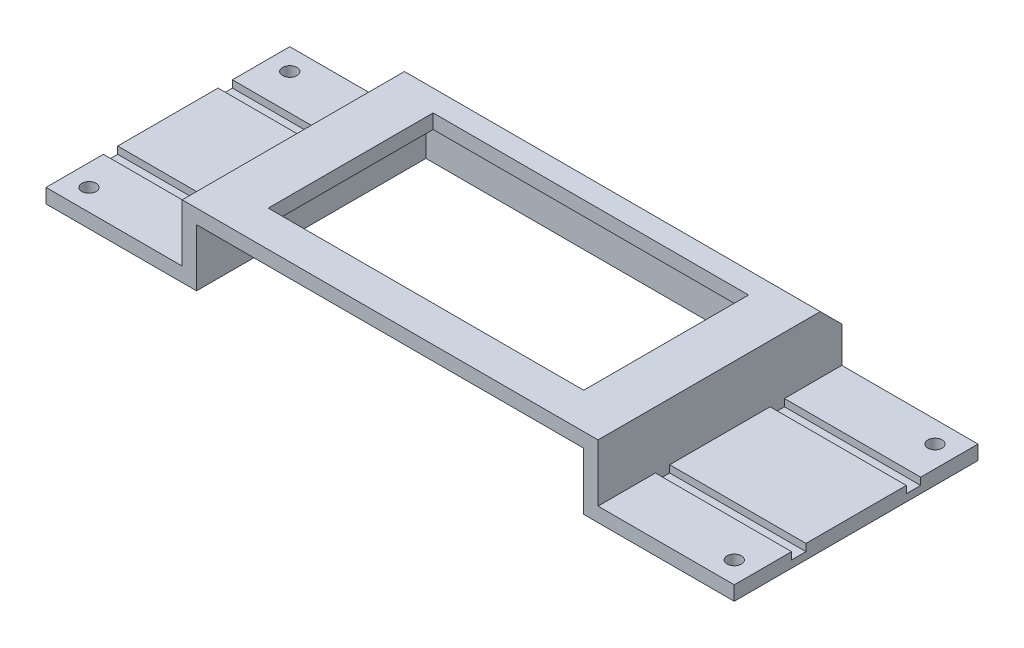
ISO-10303-21;
HEADER;
FILE_DESCRIPTION(('STEP AP214'),'2;1');
FILE_NAME('part.step','',(''),(''),'','','');
FILE_SCHEMA(('AUTOMOTIVE_DESIGN { 1 0 10303 214 1 1 1 1 }'));
ENDSEC;
DATA;
#1=APPLICATION_CONTEXT('core data for automotive mechanical design processes');
#2=APPLICATION_PROTOCOL_DEFINITION('international standard','automotive_design',2000,#1);
#3=PRODUCT_CONTEXT('',#1,'mechanical');
#4=PRODUCT('Part','Part','',(#3));
#5=PRODUCT_RELATED_PRODUCT_CATEGORY('part','',(#4));
#6=PRODUCT_DEFINITION_FORMATION('','',#4);
#7=PRODUCT_DEFINITION_CONTEXT('part definition',#1,'design');
#8=PRODUCT_DEFINITION('design','',#6,#7);
#9=PRODUCT_DEFINITION_SHAPE('','',#8);
#10=(LENGTH_UNIT() NAMED_UNIT(*) SI_UNIT(.MILLI.,.METRE.));
#11=(NAMED_UNIT(*) PLANE_ANGLE_UNIT() SI_UNIT($,.RADIAN.));
#12=(NAMED_UNIT(*) SI_UNIT($,.STERADIAN.) SOLID_ANGLE_UNIT());
#13=UNCERTAINTY_MEASURE_WITH_UNIT(LENGTH_MEASURE(1.E-05),#10,'distance_accuracy_value','');
#14=(GEOMETRIC_REPRESENTATION_CONTEXT(3) GLOBAL_UNCERTAINTY_ASSIGNED_CONTEXT((#13)) GLOBAL_UNIT_ASSIGNED_CONTEXT((#10,
#11,#12)) REPRESENTATION_CONTEXT('',''));
#15=CARTESIAN_POINT('',(0.,0.,0.));
#16=DIRECTION('',(0.,0.,1.));
#17=DIRECTION('',(1.,0.,0.));
#18=AXIS2_PLACEMENT_3D('',#15,#16,#17);
#19=CARTESIAN_POINT('',(0.,1.,0.));
#20=DIRECTION('',(0.,1.,0.));
#21=DIRECTION('',(0.,0.,1.));
#22=AXIS2_PLACEMENT_3D('',#19,#20,#21);
#23=PLANE('',#22);
#24=DIRECTION('',(1.,0.,0.));
#25=VECTOR('',#24,1.);
#26=CARTESIAN_POINT('',(-14.5,1.,4.5));
#27=LINE('',#26,#25);
#28=CARTESIAN_POINT('',(-24.,1.,4.5));
#29=VERTEX_POINT('',#28);
#30=CARTESIAN_POINT('',(-14.5,1.,4.5));
#31=VERTEX_POINT('',#30);
#32=EDGE_CURVE('E57',#29,#31,#27,.T.);
#33=ORIENTED_EDGE('',*,*,#32,.F.);
#34=DIRECTION('',(0.,0.,1.));
#35=VECTOR('',#34,1.);
#36=CARTESIAN_POINT('',(-24.,1.,8.5));
#37=LINE('',#36,#35);
#38=CARTESIAN_POINT('',(-24.,1.,8.5));
#39=VERTEX_POINT('',#38);
#40=EDGE_CURVE('E549',#29,#39,#37,.T.);
#41=ORIENTED_EDGE('',*,*,#40,.T.);
#42=DIRECTION('',(1.,0.,0.));
#43=VECTOR('',#42,1.);
#44=CARTESIAN_POINT('',(24.,1.,8.49999999999999));
#45=LINE('',#44,#43);
#46=CARTESIAN_POINT('',(-14.5,1.,8.5));
#47=VERTEX_POINT('',#46);
#48=EDGE_CURVE('E550',#39,#47,#45,.T.);
#49=ORIENTED_EDGE('',*,*,#48,.T.);
#50=DIRECTION('',(0.,0.,1.));
#51=VECTOR('',#50,1.);
#52=CARTESIAN_POINT('',(-14.5,1.,8.50000000000001));
#53=LINE('',#52,#51);
#54=EDGE_CURVE('E506',#31,#47,#53,.T.);
#55=ORIENTED_EDGE('',*,*,#54,.F.);
#56=EDGE_LOOP('',(#33,#41,#49,#55));
#57=FACE_BOUND('',#56,.T.);
#58=CARTESIAN_POINT('',(-22.5,1.,7.));
#59=DIRECTION('',(0.,1.,0.));
#60=DIRECTION('',(0.,0.,-1.));
#61=AXIS2_PLACEMENT_3D('',#58,#59,#60);
#62=CIRCLE('',#61,0.499999999999999);
#63=CARTESIAN_POINT('',(-22.5,1.,6.5));
#64=VERTEX_POINT('',#63);
#65=EDGE_CURVE('E398',#64,#64,#62,.T.);
#66=ORIENTED_EDGE('',*,*,#65,.F.);
#67=EDGE_LOOP('',(#66));
#68=FACE_BOUND('',#67,.T.);
#69=ADVANCED_FACE('F41',(#57,#68),#23,.T.);
#70=DIRECTION('',(-1.,0.,0.));
#71=VECTOR('',#70,1.);
#72=CARTESIAN_POINT('',(-14.5,1.,-4.5));
#73=LINE('',#72,#71);
#74=CARTESIAN_POINT('',(-14.5,1.,-4.5));
#75=VERTEX_POINT('',#74);
#76=CARTESIAN_POINT('',(-24.,1.,-4.5));
#77=VERTEX_POINT('',#76);
#78=EDGE_CURVE('E377',#75,#77,#73,.T.);
#79=ORIENTED_EDGE('',*,*,#78,.F.);
#80=CARTESIAN_POINT('',(-14.5,1.,-8.5));
#81=VERTEX_POINT('',#80);
#82=EDGE_CURVE('E519',#81,#75,#53,.T.);
#83=ORIENTED_EDGE('',*,*,#82,.F.);
#84=DIRECTION('',(-1.,0.,0.));
#85=VECTOR('',#84,1.);
#86=CARTESIAN_POINT('',(24.,1.,-8.50000000000001));
#87=LINE('',#86,#85);
#88=CARTESIAN_POINT('',(-24.,1.,-8.5));
#89=VERTEX_POINT('',#88);
#90=EDGE_CURVE('E559',#81,#89,#87,.T.);
#91=ORIENTED_EDGE('',*,*,#90,.T.);
#92=EDGE_CURVE('E543',#89,#77,#37,.T.);
#93=ORIENTED_EDGE('',*,*,#92,.T.);
#94=EDGE_LOOP('',(#79,#83,#91,#93));
#95=FACE_BOUND('',#94,.T.);
#96=CARTESIAN_POINT('',(-22.5,1.,-7.));
#97=DIRECTION('',(0.,1.,0.));
#98=DIRECTION('',(0.,0.,1.));
#99=AXIS2_PLACEMENT_3D('',#96,#97,#98);
#100=CIRCLE('',#99,0.499999999999999);
#101=CARTESIAN_POINT('',(-22.5,1.,-6.5));
#102=VERTEX_POINT('',#101);
#103=EDGE_CURVE('E411',#102,#102,#100,.T.);
#104=ORIENTED_EDGE('',*,*,#103,.F.);
#105=EDGE_LOOP('',(#104));
#106=FACE_BOUND('',#105,.T.);
#107=ADVANCED_FACE('F688',(#95,#106),#23,.T.);
#108=DIRECTION('',(-1.,0.,0.));
#109=VECTOR('',#108,1.);
#110=CARTESIAN_POINT('',(14.5,1.,-4.5));
#111=LINE('',#110,#109);
#112=CARTESIAN_POINT('',(24.,1.,-4.49999999999999));
#113=VERTEX_POINT('',#112);
#114=CARTESIAN_POINT('',(14.5,1.,-4.5));
#115=VERTEX_POINT('',#114);
#116=EDGE_CURVE('E343',#113,#115,#111,.T.);
#117=ORIENTED_EDGE('',*,*,#116,.F.);
#118=DIRECTION('',(0.,0.,-1.));
#119=VECTOR('',#118,1.);
#120=CARTESIAN_POINT('',(24.,1.,8.49999999999999));
#121=LINE('',#120,#119);
#122=CARTESIAN_POINT('',(24.,1.,-8.50000000000001));
#123=VERTEX_POINT('',#122);
#124=EDGE_CURVE('E554',#113,#123,#121,.T.);
#125=ORIENTED_EDGE('',*,*,#124,.T.);
#126=CARTESIAN_POINT('',(14.5,1.,-8.50000000000001));
#127=VERTEX_POINT('',#126);
#128=EDGE_CURVE('E561',#123,#127,#87,.T.);
#129=ORIENTED_EDGE('',*,*,#128,.T.);
#130=DIRECTION('',(0.,0.,-1.));
#131=VECTOR('',#130,1.);
#132=CARTESIAN_POINT('',(14.5,1.,8.50000000000001));
#133=LINE('',#132,#131);
#134=EDGE_CURVE('E523',#115,#127,#133,.T.);
#135=ORIENTED_EDGE('',*,*,#134,.F.);
#136=EDGE_LOOP('',(#117,#125,#129,#135));
#137=FACE_BOUND('',#136,.T.);
#138=CARTESIAN_POINT('',(22.5,1.,-7.00000000000001));
#139=DIRECTION('',(0.,1.,0.));
#140=DIRECTION('',(0.,0.,-1.));
#141=AXIS2_PLACEMENT_3D('',#138,#139,#140);
#142=CIRCLE('',#141,0.499999999999999);
#143=CARTESIAN_POINT('',(22.5,1.,-7.50000000000001));
#144=VERTEX_POINT('',#143);
#145=EDGE_CURVE('E412',#144,#144,#142,.T.);
#146=ORIENTED_EDGE('',*,*,#145,.F.);
#147=EDGE_LOOP('',(#146));
#148=FACE_BOUND('',#147,.T.);
#149=ADVANCED_FACE('F728',(#137,#148),#23,.T.);
#150=DIRECTION('',(1.,0.,0.));
#151=VECTOR('',#150,1.);
#152=CARTESIAN_POINT('',(14.5,1.,-3.5));
#153=LINE('',#152,#151);
#154=CARTESIAN_POINT('',(14.5,1.,-3.5));
#155=VERTEX_POINT('',#154);
#156=CARTESIAN_POINT('',(24.,1.,-3.50000000000001));
#157=VERTEX_POINT('',#156);
#158=EDGE_CURVE('E355',#155,#157,#153,.T.);
#159=ORIENTED_EDGE('',*,*,#158,.F.);
#160=CARTESIAN_POINT('',(14.5,1.,3.5));
#161=VERTEX_POINT('',#160);
#162=EDGE_CURVE('E527',#161,#155,#133,.T.);
#163=ORIENTED_EDGE('',*,*,#162,.F.);
#164=DIRECTION('',(-1.,0.,0.));
#165=VECTOR('',#164,1.);
#166=CARTESIAN_POINT('',(14.5,1.,3.5));
#167=LINE('',#166,#165);
#168=CARTESIAN_POINT('',(24.,1.,3.50000000000001));
#169=VERTEX_POINT('',#168);
#170=EDGE_CURVE('E308',#169,#161,#167,.T.);
#171=ORIENTED_EDGE('',*,*,#170,.F.);
#172=EDGE_CURVE('E560',#169,#157,#121,.T.);
#173=ORIENTED_EDGE('',*,*,#172,.T.);
#174=EDGE_LOOP('',(#159,#163,#171,#173));
#175=FACE_BOUND('',#174,.T.);
#176=ADVANCED_FACE('F670',(#175),#23,.T.);
#177=DIRECTION('',(-1.,0.,0.));
#178=VECTOR('',#177,1.);
#179=CARTESIAN_POINT('',(-14.5,1.,3.5));
#180=LINE('',#179,#178);
#181=CARTESIAN_POINT('',(-14.5,1.,3.5));
#182=VERTEX_POINT('',#181);
#183=CARTESIAN_POINT('',(-24.,1.,3.5));
#184=VERTEX_POINT('',#183);
#185=EDGE_CURVE('E285',#182,#184,#180,.T.);
#186=ORIENTED_EDGE('',*,*,#185,.F.);
#187=CARTESIAN_POINT('',(-14.5,1.,-3.5));
#188=VERTEX_POINT('',#187);
#189=EDGE_CURVE('E264',#188,#182,#53,.T.);
#190=ORIENTED_EDGE('',*,*,#189,.F.);
#191=DIRECTION('',(1.,0.,0.));
#192=VECTOR('',#191,1.);
#193=CARTESIAN_POINT('',(-14.5,1.,-3.5));
#194=LINE('',#193,#192);
#195=CARTESIAN_POINT('',(-24.,1.,-3.5));
#196=VERTEX_POINT('',#195);
#197=EDGE_CURVE('E65',#196,#188,#194,.T.);
#198=ORIENTED_EDGE('',*,*,#197,.F.);
#199=EDGE_CURVE('E548',#196,#184,#37,.T.);
#200=ORIENTED_EDGE('',*,*,#199,.T.);
#201=EDGE_LOOP('',(#186,#190,#198,#200));
#202=FACE_BOUND('',#201,.T.);
#203=ADVANCED_FACE('F705',(#202),#23,.T.);
#204=CARTESIAN_POINT('',(-24.,1.,8.5));
#205=DIRECTION('',(1.,0.,0.));
#206=DIRECTION('',(0.,0.,-1.));
#207=AXIS2_PLACEMENT_3D('',#204,#205,#206);
#208=PLANE('',#207);
#209=ORIENTED_EDGE('',*,*,#40,.F.);
#210=DIRECTION('',(0.,1.,0.));
#211=VECTOR('',#210,1.);
#212=CARTESIAN_POINT('',(-24.,0.5,4.5));
#213=LINE('',#212,#211);
#214=CARTESIAN_POINT('',(-24.,0.5,4.5));
#215=VERTEX_POINT('',#214);
#216=EDGE_CURVE('E298',#215,#29,#213,.T.);
#217=ORIENTED_EDGE('',*,*,#216,.F.);
#218=DIRECTION('',(0.,0.,1.));
#219=VECTOR('',#218,1.);
#220=CARTESIAN_POINT('',(-24.,0.5,3.5));
#221=LINE('',#220,#219);
#222=CARTESIAN_POINT('',(-24.,0.5,3.5));
#223=VERTEX_POINT('',#222);
#224=EDGE_CURVE('E278',#223,#215,#221,.T.);
#225=ORIENTED_EDGE('',*,*,#224,.F.);
#226=DIRECTION('',(0.,1.,0.));
#227=VECTOR('',#226,1.);
#228=CARTESIAN_POINT('',(-24.,0.5,3.5));
#229=LINE('',#228,#227);
#230=EDGE_CURVE('E268',#223,#184,#229,.T.);
#231=ORIENTED_EDGE('',*,*,#230,.T.);
#232=ORIENTED_EDGE('',*,*,#199,.F.);
#233=DIRECTION('',(0.,1.,0.));
#234=VECTOR('',#233,1.);
#235=CARTESIAN_POINT('',(-24.,0.5,-3.5));
#236=LINE('',#235,#234);
#237=CARTESIAN_POINT('',(-24.,0.5,-3.5));
#238=VERTEX_POINT('',#237);
#239=EDGE_CURVE('E389',#238,#196,#236,.T.);
#240=ORIENTED_EDGE('',*,*,#239,.F.);
#241=DIRECTION('',(0.,0.,1.));
#242=VECTOR('',#241,1.);
#243=CARTESIAN_POINT('',(-24.,0.5,-3.5));
#244=LINE('',#243,#242);
#245=CARTESIAN_POINT('',(-24.,0.5,-4.5));
#246=VERTEX_POINT('',#245);
#247=EDGE_CURVE('E372',#246,#238,#244,.T.);
#248=ORIENTED_EDGE('',*,*,#247,.F.);
#249=DIRECTION('',(0.,1.,0.));
#250=VECTOR('',#249,1.);
#251=CARTESIAN_POINT('',(-24.,0.5,-4.5));
#252=LINE('',#251,#250);
#253=EDGE_CURVE('E394',#246,#77,#252,.T.);
#254=ORIENTED_EDGE('',*,*,#253,.T.);
#255=ORIENTED_EDGE('',*,*,#92,.F.);
#256=DIRECTION('',(0.,-1.,0.));
#257=VECTOR('',#256,1.);
#258=CARTESIAN_POINT('',(-24.,1.,-8.5));
#259=LINE('',#258,#257);
#260=CARTESIAN_POINT('',(-24.,0.,-8.5));
#261=VERTEX_POINT('',#260);
#262=EDGE_CURVE('E565',#89,#261,#259,.T.);
#263=ORIENTED_EDGE('',*,*,#262,.T.);
#264=DIRECTION('',(0.,0.,1.));
#265=VECTOR('',#264,1.);
#266=CARTESIAN_POINT('',(-24.,0.,8.5));
#267=LINE('',#266,#265);
#268=CARTESIAN_POINT('',(-24.,0.,8.5));
#269=VERTEX_POINT('',#268);
#270=EDGE_CURVE('E542',#261,#269,#267,.T.);
#271=ORIENTED_EDGE('',*,*,#270,.T.);
#272=DIRECTION('',(0.,-1.,0.));
#273=VECTOR('',#272,1.);
#274=CARTESIAN_POINT('',(-24.,1.,8.5));
#275=LINE('',#274,#273);
#276=EDGE_CURVE('E591',#39,#269,#275,.T.);
#277=ORIENTED_EDGE('',*,*,#276,.F.);
#278=EDGE_LOOP('',(#209,#217,#225,#231,#232,#240,#248,#254,#255,#263,#271,#277));
#279=FACE_BOUND('',#278,.T.);
#280=ADVANCED_FACE('F695',(#279),#208,.F.);
#281=CARTESIAN_POINT('',(24.,1.,8.49999999999999));
#282=DIRECTION('',(0.,0.,-1.));
#283=DIRECTION('',(-1.,0.,0.));
#284=AXIS2_PLACEMENT_3D('',#281,#282,#283);
#285=PLANE('',#284);
#286=DIRECTION('',(-1.,0.,0.));
#287=VECTOR('',#286,1.);
#288=CARTESIAN_POINT('',(13.5,4.,8.5));
#289=LINE('',#288,#287);
#290=CARTESIAN_POINT('',(13.5,4.,8.5));
#291=VERTEX_POINT('',#290);
#292=CARTESIAN_POINT('',(-13.5,4.,8.5));
#293=VERTEX_POINT('',#292);
#294=EDGE_CURVE('E488',#291,#293,#289,.T.);
#295=ORIENTED_EDGE('',*,*,#294,.F.);
#296=DIRECTION('',(0.,-1.,0.));
#297=VECTOR('',#296,1.);
#298=CARTESIAN_POINT('',(13.5,36.3847096529504,8.5));
#299=LINE('',#298,#297);
#300=CARTESIAN_POINT('',(13.5,0.,8.5));
#301=VERTEX_POINT('',#300);
#302=EDGE_CURVE('E492',#291,#301,#299,.T.);
#303=ORIENTED_EDGE('',*,*,#302,.T.);
#304=DIRECTION('',(1.,0.,0.));
#305=VECTOR('',#304,1.);
#306=CARTESIAN_POINT('',(24.,0.,8.49999999999999));
#307=LINE('',#306,#305);
#308=CARTESIAN_POINT('',(24.,0.,8.49999999999999));
#309=VERTEX_POINT('',#308);
#310=EDGE_CURVE('E569',#301,#309,#307,.T.);
#311=ORIENTED_EDGE('',*,*,#310,.T.);
#312=DIRECTION('',(0.,-1.,0.));
#313=VECTOR('',#312,1.);
#314=CARTESIAN_POINT('',(24.,1.,8.49999999999999));
#315=LINE('',#314,#313);
#316=CARTESIAN_POINT('',(24.,1.,8.49999999999999));
#317=VERTEX_POINT('',#316);
#318=EDGE_CURVE('E587',#317,#309,#315,.T.);
#319=ORIENTED_EDGE('',*,*,#318,.F.);
#320=CARTESIAN_POINT('',(14.5,1.,8.5));
#321=VERTEX_POINT('',#320);
#322=EDGE_CURVE('E547',#321,#317,#45,.T.);
#323=ORIENTED_EDGE('',*,*,#322,.F.);
#324=DIRECTION('',(0.,-1.,0.));
#325=VECTOR('',#324,1.);
#326=CARTESIAN_POINT('',(14.5,5.,8.50000000000001));
#327=LINE('',#326,#325);
#328=CARTESIAN_POINT('',(14.5,5.,8.50000000000001));
#329=VERTEX_POINT('',#328);
#330=EDGE_CURVE('E534',#329,#321,#327,.T.);
#331=ORIENTED_EDGE('',*,*,#330,.F.);
#332=DIRECTION('',(1.,0.,0.));
#333=VECTOR('',#332,1.);
#334=CARTESIAN_POINT('',(14.5,5.,8.50000000000001));
#335=LINE('',#334,#333);
#336=CARTESIAN_POINT('',(-14.5,5.,8.50000000000001));
#337=VERTEX_POINT('',#336);
#338=EDGE_CURVE('E510',#337,#329,#335,.T.);
#339=ORIENTED_EDGE('',*,*,#338,.F.);
#340=DIRECTION('',(0.,-1.,0.));
#341=VECTOR('',#340,1.);
#342=CARTESIAN_POINT('',(-14.5,5.,8.50000000000001));
#343=LINE('',#342,#341);
#344=EDGE_CURVE('E538',#337,#47,#343,.T.);
#345=ORIENTED_EDGE('',*,*,#344,.T.);
#346=ORIENTED_EDGE('',*,*,#48,.F.);
#347=ORIENTED_EDGE('',*,*,#276,.T.);
#348=CARTESIAN_POINT('',(-13.5,0.,8.5));
#349=VERTEX_POINT('',#348);
#350=EDGE_CURVE('E570',#269,#349,#307,.T.);
#351=ORIENTED_EDGE('',*,*,#350,.T.);
#352=DIRECTION('',(0.,-1.,0.));
#353=VECTOR('',#352,1.);
#354=CARTESIAN_POINT('',(-13.5,36.3847096529504,8.5));
#355=LINE('',#354,#353);
#356=EDGE_CURVE('E487',#293,#349,#355,.T.);
#357=ORIENTED_EDGE('',*,*,#356,.F.);
#358=EDGE_LOOP('',(#295,#303,#311,#319,#323,#331,#339,#345,#346,#347,#351,#357));
#359=FACE_BOUND('',#358,.T.);
#360=ADVANCED_FACE('F640',(#359),#285,.F.);
#361=CARTESIAN_POINT('',(24.,1.,8.49999999999999));
#362=DIRECTION('',(-1.,0.,0.));
#363=DIRECTION('',(0.,0.,1.));
#364=AXIS2_PLACEMENT_3D('',#361,#362,#363);
#365=PLANE('',#364);
#366=ORIENTED_EDGE('',*,*,#124,.F.);
#367=DIRECTION('',(0.,1.,0.));
#368=VECTOR('',#367,1.);
#369=CARTESIAN_POINT('',(24.,0.5,-4.49999999999999));
#370=LINE('',#369,#368);
#371=CARTESIAN_POINT('',(24.,0.5,-4.49999999999999));
#372=VERTEX_POINT('',#371);
#373=EDGE_CURVE('E363',#372,#113,#370,.T.);
#374=ORIENTED_EDGE('',*,*,#373,.F.);
#375=DIRECTION('',(0.,0.,-1.));
#376=VECTOR('',#375,1.);
#377=CARTESIAN_POINT('',(24.,0.5,-3.50000000000001));
#378=LINE('',#377,#376);
#379=CARTESIAN_POINT('',(24.,0.5,-3.50000000000001));
#380=VERTEX_POINT('',#379);
#381=EDGE_CURVE('E347',#380,#372,#378,.T.);
#382=ORIENTED_EDGE('',*,*,#381,.F.);
#383=DIRECTION('',(0.,1.,0.));
#384=VECTOR('',#383,1.);
#385=CARTESIAN_POINT('',(24.,0.5,-3.50000000000001));
#386=LINE('',#385,#384);
#387=EDGE_CURVE('E366',#380,#157,#386,.T.);
#388=ORIENTED_EDGE('',*,*,#387,.T.);
#389=ORIENTED_EDGE('',*,*,#172,.F.);
#390=DIRECTION('',(0.,1.,0.));
#391=VECTOR('',#390,1.);
#392=CARTESIAN_POINT('',(24.,0.5,3.50000000000001));
#393=LINE('',#392,#391);
#394=CARTESIAN_POINT('',(24.,0.5,3.50000000000001));
#395=VERTEX_POINT('',#394);
#396=EDGE_CURVE('E329',#395,#169,#393,.T.);
#397=ORIENTED_EDGE('',*,*,#396,.F.);
#398=DIRECTION('',(0.,0.,-1.));
#399=VECTOR('',#398,1.);
#400=CARTESIAN_POINT('',(24.,0.5,3.50000000000001));
#401=LINE('',#400,#399);
#402=CARTESIAN_POINT('',(24.,0.5,4.49999999999999));
#403=VERTEX_POINT('',#402);
#404=EDGE_CURVE('E312',#403,#395,#401,.T.);
#405=ORIENTED_EDGE('',*,*,#404,.F.);
#406=DIRECTION('',(0.,1.,0.));
#407=VECTOR('',#406,1.);
#408=CARTESIAN_POINT('',(24.,0.5,4.49999999999999));
#409=LINE('',#408,#407);
#410=CARTESIAN_POINT('',(24.,1.,4.49999999999999));
#411=VERTEX_POINT('',#410);
#412=EDGE_CURVE('E332',#403,#411,#409,.T.);
#413=ORIENTED_EDGE('',*,*,#412,.T.);
#414=EDGE_CURVE('E555',#317,#411,#121,.T.);
#415=ORIENTED_EDGE('',*,*,#414,.F.);
#416=ORIENTED_EDGE('',*,*,#318,.T.);
#417=DIRECTION('',(0.,0.,-1.));
#418=VECTOR('',#417,1.);
#419=CARTESIAN_POINT('',(24.,0.,8.49999999999999));
#420=LINE('',#419,#418);
#421=CARTESIAN_POINT('',(24.,0.,-8.50000000000001));
#422=VERTEX_POINT('',#421);
#423=EDGE_CURVE('E574',#309,#422,#420,.T.);
#424=ORIENTED_EDGE('',*,*,#423,.T.);
#425=DIRECTION('',(0.,-1.,0.));
#426=VECTOR('',#425,1.);
#427=CARTESIAN_POINT('',(24.,1.,-8.50000000000001));
#428=LINE('',#427,#426);
#429=EDGE_CURVE('E583',#123,#422,#428,.T.);
#430=ORIENTED_EDGE('',*,*,#429,.F.);
#431=EDGE_LOOP('',(#366,#374,#382,#388,#389,#397,#405,#413,#415,#416,#424,#430));
#432=FACE_BOUND('',#431,.T.);
#433=ADVANCED_FACE('F657',(#432),#365,.F.);
#434=CARTESIAN_POINT('',(24.,1.,-8.50000000000001));
#435=DIRECTION('',(0.,0.,1.));
#436=DIRECTION('',(1.,0.,0.));
#437=AXIS2_PLACEMENT_3D('',#434,#435,#436);
#438=PLANE('',#437);
#439=DIRECTION('',(0.,-1.,0.));
#440=VECTOR('',#439,1.);
#441=CARTESIAN_POINT('',(-14.5,5.,-8.50000000000001));
#442=LINE('',#441,#440);
#443=CARTESIAN_POINT('',(-14.5,3.50000000000001,-8.50000000000001));
#444=VERTEX_POINT('',#443);
#445=EDGE_CURVE('E518',#444,#81,#442,.T.);
#446=ORIENTED_EDGE('',*,*,#445,.F.);
#447=DIRECTION('',(1.,0.,0.));
#448=VECTOR('',#447,1.);
#449=CARTESIAN_POINT('',(14.5,3.50000000000001,-8.5));
#450=LINE('',#449,#448);
#451=CARTESIAN_POINT('',(14.5,3.50000000000001,-8.50000000000001));
#452=VERTEX_POINT('',#451);
#453=EDGE_CURVE('E50',#444,#452,#450,.T.);
#454=ORIENTED_EDGE('',*,*,#453,.T.);
#455=DIRECTION('',(0.,-1.,0.));
#456=VECTOR('',#455,1.);
#457=CARTESIAN_POINT('',(14.5,5.,-8.50000000000001));
#458=LINE('',#457,#456);
#459=EDGE_CURVE('E530',#452,#127,#458,.T.);
#460=ORIENTED_EDGE('',*,*,#459,.T.);
#461=ORIENTED_EDGE('',*,*,#128,.F.);
#462=ORIENTED_EDGE('',*,*,#429,.T.);
#463=DIRECTION('',(-1.,0.,0.));
#464=VECTOR('',#463,1.);
#465=CARTESIAN_POINT('',(24.,0.,-8.50000000000001));
#466=LINE('',#465,#464);
#467=EDGE_CURVE('E577',#422,#261,#466,.T.);
#468=ORIENTED_EDGE('',*,*,#467,.T.);
#469=ORIENTED_EDGE('',*,*,#262,.F.);
#470=ORIENTED_EDGE('',*,*,#90,.F.);
#471=EDGE_LOOP('',(#446,#454,#460,#461,#462,#468,#469,#470));
#472=FACE_BOUND('',#471,.T.);
#473=ADVANCED_FACE('F622',(#472),#438,.F.);
#474=DIRECTION('',(1.,0.,0.));
#475=VECTOR('',#474,1.);
#476=CARTESIAN_POINT('',(14.5,1.,4.5));
#477=LINE('',#476,#475);
#478=CARTESIAN_POINT('',(14.5,1.,4.5));
#479=VERTEX_POINT('',#478);
#480=EDGE_CURVE('E320',#479,#411,#477,.T.);
#481=ORIENTED_EDGE('',*,*,#480,.F.);
#482=EDGE_CURVE('E511',#321,#479,#133,.T.);
#483=ORIENTED_EDGE('',*,*,#482,.F.);
#484=ORIENTED_EDGE('',*,*,#322,.T.);
#485=ORIENTED_EDGE('',*,*,#414,.T.);
#486=EDGE_LOOP('',(#481,#483,#484,#485));
#487=FACE_BOUND('',#486,.T.);
#488=CARTESIAN_POINT('',(22.5,1.,7.00000000000001));
#489=DIRECTION('',(0.,1.,0.));
#490=DIRECTION('',(0.,0.,1.));
#491=AXIS2_PLACEMENT_3D('',#488,#489,#490);
#492=CIRCLE('',#491,0.499999999999999);
#493=CARTESIAN_POINT('',(22.5,1.,7.50000000000001));
#494=VERTEX_POINT('',#493);
#495=EDGE_CURVE('E420',#494,#494,#492,.T.);
#496=ORIENTED_EDGE('',*,*,#495,.F.);
#497=EDGE_LOOP('',(#496));
#498=FACE_BOUND('',#497,.T.);
#499=ADVANCED_FACE('F649',(#487,#498),#23,.T.);
#500=CARTESIAN_POINT('',(0.,0.,0.));
#501=DIRECTION('',(0.,1.,0.));
#502=DIRECTION('',(0.,0.,1.));
#503=AXIS2_PLACEMENT_3D('',#500,#501,#502);
#504=PLANE('',#503);
#505=CARTESIAN_POINT('',(-22.5,0.,7.));
#506=DIRECTION('',(0.,1.,0.));
#507=DIRECTION('',(0.,0.,-1.));
#508=AXIS2_PLACEMENT_3D('',#505,#506,#507);
#509=CIRCLE('',#508,0.499999999999999);
#510=CARTESIAN_POINT('',(-22.5,0.,6.5));
#511=VERTEX_POINT('',#510);
#512=EDGE_CURVE('E424',#511,#511,#509,.T.);
#513=ORIENTED_EDGE('',*,*,#512,.T.);
#514=EDGE_LOOP('',(#513));
#515=FACE_BOUND('',#514,.T.);
#516=CARTESIAN_POINT('',(22.5,0.,7.00000000000001));
#517=DIRECTION('',(0.,1.,0.));
#518=DIRECTION('',(0.,0.,1.));
#519=AXIS2_PLACEMENT_3D('',#516,#517,#518);
#520=CIRCLE('',#519,0.499999999999999);
#521=CARTESIAN_POINT('',(22.5,0.,7.50000000000001));
#522=VERTEX_POINT('',#521);
#523=EDGE_CURVE('E416',#522,#522,#520,.T.);
#524=ORIENTED_EDGE('',*,*,#523,.T.);
#525=EDGE_LOOP('',(#524));
#526=FACE_BOUND('',#525,.T.);
#527=CARTESIAN_POINT('',(22.5,0.,-7.00000000000001));
#528=DIRECTION('',(0.,1.,0.));
#529=DIRECTION('',(0.,0.,-1.));
#530=AXIS2_PLACEMENT_3D('',#527,#528,#529);
#531=CIRCLE('',#530,0.499999999999999);
#532=CARTESIAN_POINT('',(22.5,0.,-7.50000000000001));
#533=VERTEX_POINT('',#532);
#534=EDGE_CURVE('E407',#533,#533,#531,.T.);
#535=ORIENTED_EDGE('',*,*,#534,.T.);
#536=EDGE_LOOP('',(#535));
#537=FACE_BOUND('',#536,.T.);
#538=CARTESIAN_POINT('',(-22.5,0.,-7.));
#539=DIRECTION('',(0.,1.,0.));
#540=DIRECTION('',(0.,0.,1.));
#541=AXIS2_PLACEMENT_3D('',#538,#539,#540);
#542=CIRCLE('',#541,0.499999999999999);
#543=CARTESIAN_POINT('',(-22.5,0.,-6.5));
#544=VERTEX_POINT('',#543);
#545=EDGE_CURVE('E431',#544,#544,#542,.T.);
#546=ORIENTED_EDGE('',*,*,#545,.T.);
#547=EDGE_LOOP('',(#546));
#548=FACE_BOUND('',#547,.T.);
#549=ORIENTED_EDGE('',*,*,#310,.F.);
#550=DIRECTION('',(0.,0.,1.));
#551=VECTOR('',#550,1.);
#552=CARTESIAN_POINT('',(13.5,0.,-7.5));
#553=LINE('',#552,#551);
#554=CARTESIAN_POINT('',(13.5,0.,-7.5));
#555=VERTEX_POINT('',#554);
#556=EDGE_CURVE('E467',#555,#301,#553,.T.);
#557=ORIENTED_EDGE('',*,*,#556,.F.);
#558=DIRECTION('',(1.,0.,0.));
#559=VECTOR('',#558,1.);
#560=CARTESIAN_POINT('',(13.5,0.,-7.5));
#561=LINE('',#560,#559);
#562=CARTESIAN_POINT('',(-13.5,0.,-7.5));
#563=VERTEX_POINT('',#562);
#564=EDGE_CURVE('E471',#563,#555,#561,.T.);
#565=ORIENTED_EDGE('',*,*,#564,.F.);
#566=DIRECTION('',(0.,0.,-1.));
#567=VECTOR('',#566,1.);
#568=CARTESIAN_POINT('',(-13.5,0.,-7.5));
#569=LINE('',#568,#567);
#570=EDGE_CURVE('E457',#349,#563,#569,.T.);
#571=ORIENTED_EDGE('',*,*,#570,.F.);
#572=ORIENTED_EDGE('',*,*,#350,.F.);
#573=ORIENTED_EDGE('',*,*,#270,.F.);
#574=ORIENTED_EDGE('',*,*,#467,.F.);
#575=ORIENTED_EDGE('',*,*,#423,.F.);
#576=EDGE_LOOP('',(#549,#557,#565,#571,#572,#573,#574,#575));
#577=FACE_BOUND('',#576,.T.);
#578=ADVANCED_FACE('F715',(#515,#526,#537,#548,#577),#504,.F.);
#579=CARTESIAN_POINT('',(-14.5,5.,8.50000000000001));
#580=DIRECTION('',(1.,0.,0.));
#581=DIRECTION('',(0.,0.,-1.));
#582=AXIS2_PLACEMENT_3D('',#579,#580,#581);
#583=PLANE('',#582);
#584=DIRECTION('',(0.,0.,1.));
#585=VECTOR('',#584,1.);
#586=CARTESIAN_POINT('',(-14.5,5.,8.50000000000001));
#587=LINE('',#586,#585);
#588=CARTESIAN_POINT('',(-14.5,5.,-7.00000000000001));
#589=VERTEX_POINT('',#588);
#590=EDGE_CURVE('E507',#589,#337,#587,.T.);
#591=ORIENTED_EDGE('',*,*,#590,.F.);
#592=DIRECTION('',(0.,-0.707106781186549,-0.707106781186546));
#593=VECTOR('',#592,1.);
#594=CARTESIAN_POINT('',(-14.5,5.,-7.00000000000001));
#595=LINE('',#594,#593);
#596=EDGE_CURVE('E615',#589,#444,#595,.T.);
#597=ORIENTED_EDGE('',*,*,#596,.T.);
#598=ORIENTED_EDGE('',*,*,#445,.T.);
#599=ORIENTED_EDGE('',*,*,#82,.T.);
#600=DIRECTION('',(0.,1.,0.));
#601=VECTOR('',#600,1.);
#602=CARTESIAN_POINT('',(-14.5,0.5,-4.5));
#603=LINE('',#602,#601);
#604=CARTESIAN_POINT('',(-14.5,0.5,-4.5));
#605=VERTEX_POINT('',#604);
#606=EDGE_CURVE('E399',#605,#75,#603,.T.);
#607=ORIENTED_EDGE('',*,*,#606,.F.);
#608=DIRECTION('',(0.,0.,-1.));
#609=VECTOR('',#608,1.);
#610=CARTESIAN_POINT('',(-14.5,0.5,-3.5));
#611=LINE('',#610,#609);
#612=CARTESIAN_POINT('',(-14.5,0.5,-3.5));
#613=VERTEX_POINT('',#612);
#614=EDGE_CURVE('E381',#613,#605,#611,.T.);
#615=ORIENTED_EDGE('',*,*,#614,.F.);
#616=DIRECTION('',(0.,1.,0.));
#617=VECTOR('',#616,1.);
#618=CARTESIAN_POINT('',(-14.5,0.5,-3.5));
#619=LINE('',#618,#617);
#620=EDGE_CURVE('E402',#613,#188,#619,.T.);
#621=ORIENTED_EDGE('',*,*,#620,.T.);
#622=ORIENTED_EDGE('',*,*,#189,.T.);
#623=DIRECTION('',(0.,1.,0.));
#624=VECTOR('',#623,1.);
#625=CARTESIAN_POINT('',(-14.5,0.5,3.5));
#626=LINE('',#625,#624);
#627=CARTESIAN_POINT('',(-14.5,0.5,3.5));
#628=VERTEX_POINT('',#627);
#629=EDGE_CURVE('E256',#628,#182,#626,.T.);
#630=ORIENTED_EDGE('',*,*,#629,.F.);
#631=DIRECTION('',(0.,0.,-1.));
#632=VECTOR('',#631,1.);
#633=CARTESIAN_POINT('',(-14.5,0.5,3.5));
#634=LINE('',#633,#632);
#635=CARTESIAN_POINT('',(-14.5,0.5,4.5));
#636=VERTEX_POINT('',#635);
#637=EDGE_CURVE('E261',#636,#628,#634,.T.);
#638=ORIENTED_EDGE('',*,*,#637,.F.);
#639=DIRECTION('',(0.,1.,0.));
#640=VECTOR('',#639,1.);
#641=CARTESIAN_POINT('',(-14.5,0.5,4.5));
#642=LINE('',#641,#640);
#643=EDGE_CURVE('E295',#636,#31,#642,.T.);
#644=ORIENTED_EDGE('',*,*,#643,.T.);
#645=ORIENTED_EDGE('',*,*,#54,.T.);
#646=ORIENTED_EDGE('',*,*,#344,.F.);
#647=EDGE_LOOP('',(#591,#597,#598,#599,#607,#615,#621,#622,#630,#638,#644,#645,#646));
#648=FACE_BOUND('',#647,.T.);
#649=ADVANCED_FACE('F259',(#648),#583,.F.);
#650=CARTESIAN_POINT('',(14.5,5.,8.50000000000001));
#651=DIRECTION('',(-1.,0.,0.));
#652=DIRECTION('',(0.,0.,1.));
#653=AXIS2_PLACEMENT_3D('',#650,#651,#652);
#654=PLANE('',#653);
#655=ORIENTED_EDGE('',*,*,#459,.F.);
#656=DIRECTION('',(0.,0.707106781186549,0.707106781186546));
#657=VECTOR('',#656,1.);
#658=CARTESIAN_POINT('',(14.5,5.,-7.00000000000002));
#659=LINE('',#658,#657);
#660=CARTESIAN_POINT('',(14.5,5.,-7.00000000000002));
#661=VERTEX_POINT('',#660);
#662=EDGE_CURVE('E12',#452,#661,#659,.T.);
#663=ORIENTED_EDGE('',*,*,#662,.T.);
#664=DIRECTION('',(0.,0.,-1.));
#665=VECTOR('',#664,1.);
#666=CARTESIAN_POINT('',(14.5,5.,8.50000000000001));
#667=LINE('',#666,#665);
#668=EDGE_CURVE('E514',#329,#661,#667,.T.);
#669=ORIENTED_EDGE('',*,*,#668,.F.);
#670=ORIENTED_EDGE('',*,*,#330,.T.);
#671=ORIENTED_EDGE('',*,*,#482,.T.);
#672=DIRECTION('',(0.,1.,0.));
#673=VECTOR('',#672,1.);
#674=CARTESIAN_POINT('',(14.5,0.5,4.5));
#675=LINE('',#674,#673);
#676=CARTESIAN_POINT('',(14.5,0.5,4.5));
#677=VERTEX_POINT('',#676);
#678=EDGE_CURVE('E319',#677,#479,#675,.T.);
#679=ORIENTED_EDGE('',*,*,#678,.F.);
#680=DIRECTION('',(0.,0.,1.));
#681=VECTOR('',#680,1.);
#682=CARTESIAN_POINT('',(14.5,0.5,3.5));
#683=LINE('',#682,#681);
#684=CARTESIAN_POINT('',(14.5,0.5,3.5));
#685=VERTEX_POINT('',#684);
#686=EDGE_CURVE('E303',#685,#677,#683,.T.);
#687=ORIENTED_EDGE('',*,*,#686,.F.);
#688=DIRECTION('',(0.,1.,0.));
#689=VECTOR('',#688,1.);
#690=CARTESIAN_POINT('',(14.5,0.5,3.5));
#691=LINE('',#690,#689);
#692=EDGE_CURVE('E293',#685,#161,#691,.T.);
#693=ORIENTED_EDGE('',*,*,#692,.T.);
#694=ORIENTED_EDGE('',*,*,#162,.T.);
#695=DIRECTION('',(0.,1.,0.));
#696=VECTOR('',#695,1.);
#697=CARTESIAN_POINT('',(14.5,0.5,-3.5));
#698=LINE('',#697,#696);
#699=CARTESIAN_POINT('',(14.5,0.5,-3.5));
#700=VERTEX_POINT('',#699);
#701=EDGE_CURVE('E354',#700,#155,#698,.T.);
#702=ORIENTED_EDGE('',*,*,#701,.F.);
#703=DIRECTION('',(0.,0.,1.));
#704=VECTOR('',#703,1.);
#705=CARTESIAN_POINT('',(14.5,0.5,-3.5));
#706=LINE('',#705,#704);
#707=CARTESIAN_POINT('',(14.5,0.5,-4.5));
#708=VERTEX_POINT('',#707);
#709=EDGE_CURVE('E338',#708,#700,#706,.T.);
#710=ORIENTED_EDGE('',*,*,#709,.F.);
#711=DIRECTION('',(0.,1.,0.));
#712=VECTOR('',#711,1.);
#713=CARTESIAN_POINT('',(14.5,0.5,-4.5));
#714=LINE('',#713,#712);
#715=EDGE_CURVE('E323',#708,#115,#714,.T.);
#716=ORIENTED_EDGE('',*,*,#715,.T.);
#717=ORIENTED_EDGE('',*,*,#134,.T.);
#718=EDGE_LOOP('',(#655,#663,#669,#670,#671,#679,#687,#693,#694,#702,#710,#716,#717));
#719=FACE_BOUND('',#718,.T.);
#720=ADVANCED_FACE('F628',(#719),#654,.F.);
#721=CARTESIAN_POINT('',(0.,5.,0.));
#722=DIRECTION('',(0.,1.,0.));
#723=DIRECTION('',(0.,0.,1.));
#724=AXIS2_PLACEMENT_3D('',#721,#722,#723);
#725=PLANE('',#724);
#726=DIRECTION('',(0.,0.,1.));
#727=VECTOR('',#726,1.);
#728=CARTESIAN_POINT('',(-11.,5.,6.));
#729=LINE('',#728,#727);
#730=CARTESIAN_POINT('',(-11.,5.,-5.5));
#731=VERTEX_POINT('',#730);
#732=CARTESIAN_POINT('',(-11.,5.,6.));
#733=VERTEX_POINT('',#732);
#734=EDGE_CURVE('E435',#731,#733,#729,.T.);
#735=ORIENTED_EDGE('',*,*,#734,.F.);
#736=DIRECTION('',(-1.,0.,0.));
#737=VECTOR('',#736,1.);
#738=CARTESIAN_POINT('',(11.,5.,-5.50000000000001));
#739=LINE('',#738,#737);
#740=CARTESIAN_POINT('',(11.,5.,-5.50000000000001));
#741=VERTEX_POINT('',#740);
#742=EDGE_CURVE('E449',#741,#731,#739,.T.);
#743=ORIENTED_EDGE('',*,*,#742,.F.);
#744=DIRECTION('',(0.,0.,-1.));
#745=VECTOR('',#744,1.);
#746=CARTESIAN_POINT('',(11.,5.,5.99999999999999));
#747=LINE('',#746,#745);
#748=CARTESIAN_POINT('',(11.,5.,5.99999999999999));
#749=VERTEX_POINT('',#748);
#750=EDGE_CURVE('E445',#749,#741,#747,.T.);
#751=ORIENTED_EDGE('',*,*,#750,.F.);
#752=DIRECTION('',(1.,0.,0.));
#753=VECTOR('',#752,1.);
#754=CARTESIAN_POINT('',(11.,5.,5.99999999999999));
#755=LINE('',#754,#753);
#756=EDGE_CURVE('E441',#733,#749,#755,.T.);
#757=ORIENTED_EDGE('',*,*,#756,.F.);
#758=EDGE_LOOP('',(#735,#743,#751,#757));
#759=FACE_BOUND('',#758,.T.);
#760=ORIENTED_EDGE('',*,*,#668,.T.);
#761=DIRECTION('',(-1.,0.,0.));
#762=VECTOR('',#761,1.);
#763=CARTESIAN_POINT('',(-14.5,5.,-7.00000000000001));
#764=LINE('',#763,#762);
#765=EDGE_CURVE('E611',#661,#589,#764,.T.);
#766=ORIENTED_EDGE('',*,*,#765,.T.);
#767=ORIENTED_EDGE('',*,*,#590,.T.);
#768=ORIENTED_EDGE('',*,*,#338,.T.);
#769=EDGE_LOOP('',(#760,#766,#767,#768));
#770=FACE_BOUND('',#769,.T.);
#771=ADVANCED_FACE('F633',(#759,#770),#725,.T.);
#772=CARTESIAN_POINT('',(0.,4.,0.));
#773=DIRECTION('',(0.,1.,0.));
#774=DIRECTION('',(0.,0.,1.));
#775=AXIS2_PLACEMENT_3D('',#772,#773,#774);
#776=PLANE('',#775);
#777=DIRECTION('',(-1.,0.,0.));
#778=VECTOR('',#777,1.);
#779=CARTESIAN_POINT('',(0.,4.,-5.5));
#780=LINE('',#779,#778);
#781=CARTESIAN_POINT('',(11.,4.,-5.50000000000001));
#782=VERTEX_POINT('',#781);
#783=CARTESIAN_POINT('',(-11.,4.,-5.5));
#784=VERTEX_POINT('',#783);
#785=EDGE_CURVE('E603',#782,#784,#780,.T.);
#786=ORIENTED_EDGE('',*,*,#785,.T.);
#787=DIRECTION('',(0.,0.,1.));
#788=VECTOR('',#787,1.);
#789=CARTESIAN_POINT('',(-11.,4.,0.));
#790=LINE('',#789,#788);
#791=CARTESIAN_POINT('',(-11.,4.,6.));
#792=VERTEX_POINT('',#791);
#793=EDGE_CURVE('E607',#784,#792,#790,.T.);
#794=ORIENTED_EDGE('',*,*,#793,.T.);
#795=DIRECTION('',(1.,0.,0.));
#796=VECTOR('',#795,1.);
#797=CARTESIAN_POINT('',(0.,4.,6.));
#798=LINE('',#797,#796);
#799=CARTESIAN_POINT('',(11.,4.,5.99999999999999));
#800=VERTEX_POINT('',#799);
#801=EDGE_CURVE('E595',#792,#800,#798,.T.);
#802=ORIENTED_EDGE('',*,*,#801,.T.);
#803=DIRECTION('',(0.,0.,-1.));
#804=VECTOR('',#803,1.);
#805=CARTESIAN_POINT('',(11.,4.,0.));
#806=LINE('',#805,#804);
#807=EDGE_CURVE('E599',#800,#782,#806,.T.);
#808=ORIENTED_EDGE('',*,*,#807,.T.);
#809=EDGE_LOOP('',(#786,#794,#802,#808));
#810=FACE_BOUND('',#809,.T.);
#811=DIRECTION('',(0.,0.,-1.));
#812=VECTOR('',#811,1.);
#813=CARTESIAN_POINT('',(-13.5,4.,-7.5));
#814=LINE('',#813,#812);
#815=CARTESIAN_POINT('',(-13.5,4.,-7.5));
#816=VERTEX_POINT('',#815);
#817=EDGE_CURVE('E482',#293,#816,#814,.T.);
#818=ORIENTED_EDGE('',*,*,#817,.T.);
#819=DIRECTION('',(1.,0.,0.));
#820=VECTOR('',#819,1.);
#821=CARTESIAN_POINT('',(13.5,4.,-7.5));
#822=LINE('',#821,#820);
#823=CARTESIAN_POINT('',(13.5,4.,-7.5));
#824=VERTEX_POINT('',#823);
#825=EDGE_CURVE('E470',#816,#824,#822,.T.);
#826=ORIENTED_EDGE('',*,*,#825,.T.);
#827=DIRECTION('',(0.,0.,1.));
#828=VECTOR('',#827,1.);
#829=CARTESIAN_POINT('',(13.5,4.,-7.5));
#830=LINE('',#829,#828);
#831=EDGE_CURVE('E493',#824,#291,#830,.T.);
#832=ORIENTED_EDGE('',*,*,#831,.T.);
#833=ORIENTED_EDGE('',*,*,#294,.T.);
#834=EDGE_LOOP('',(#818,#826,#832,#833));
#835=FACE_BOUND('',#834,.T.);
#836=ADVANCED_FACE('F722',(#810,#835),#776,.F.);
#837=CARTESIAN_POINT('',(13.5,36.3847096529504,-7.5));
#838=DIRECTION('',(0.,0.,-1.));
#839=DIRECTION('',(-1.,0.,0.));
#840=AXIS2_PLACEMENT_3D('',#837,#838,#839);
#841=PLANE('',#840);
#842=DIRECTION('',(0.,-1.,0.));
#843=VECTOR('',#842,1.);
#844=CARTESIAN_POINT('',(-13.5,36.3847096529504,-7.5));
#845=LINE('',#844,#843);
#846=EDGE_CURVE('E486',#816,#563,#845,.T.);
#847=ORIENTED_EDGE('',*,*,#846,.T.);
#848=ORIENTED_EDGE('',*,*,#564,.T.);
#849=DIRECTION('',(0.,-1.,0.));
#850=VECTOR('',#849,1.);
#851=CARTESIAN_POINT('',(13.5,36.3847096529504,-7.5));
#852=LINE('',#851,#850);
#853=EDGE_CURVE('E481',#824,#555,#852,.T.);
#854=ORIENTED_EDGE('',*,*,#853,.F.);
#855=ORIENTED_EDGE('',*,*,#825,.F.);
#856=EDGE_LOOP('',(#847,#848,#854,#855));
#857=FACE_BOUND('',#856,.T.);
#858=ADVANCED_FACE('F913',(#857),#841,.F.);
#859=CARTESIAN_POINT('',(13.5,36.3847096529504,-7.5));
#860=DIRECTION('',(1.,0.,0.));
#861=DIRECTION('',(0.,0.,-1.));
#862=AXIS2_PLACEMENT_3D('',#859,#860,#861);
#863=PLANE('',#862);
#864=ORIENTED_EDGE('',*,*,#853,.T.);
#865=ORIENTED_EDGE('',*,*,#556,.T.);
#866=ORIENTED_EDGE('',*,*,#302,.F.);
#867=ORIENTED_EDGE('',*,*,#831,.F.);
#868=EDGE_LOOP('',(#864,#865,#866,#867));
#869=FACE_BOUND('',#868,.T.);
#870=ADVANCED_FACE('F923',(#869),#863,.F.);
#871=CARTESIAN_POINT('',(-13.5,36.3847096529504,-7.5));
#872=DIRECTION('',(-1.,0.,0.));
#873=DIRECTION('',(0.,0.,1.));
#874=AXIS2_PLACEMENT_3D('',#871,#872,#873);
#875=PLANE('',#874);
#876=ORIENTED_EDGE('',*,*,#356,.T.);
#877=ORIENTED_EDGE('',*,*,#570,.T.);
#878=ORIENTED_EDGE('',*,*,#846,.F.);
#879=ORIENTED_EDGE('',*,*,#817,.F.);
#880=EDGE_LOOP('',(#876,#877,#878,#879));
#881=FACE_BOUND('',#880,.T.);
#882=ADVANCED_FACE('F720',(#881),#875,.F.);
#883=CARTESIAN_POINT('',(-11.,0.,6.));
#884=DIRECTION('',(-1.,0.,0.));
#885=DIRECTION('',(0.,0.,1.));
#886=AXIS2_PLACEMENT_3D('',#883,#884,#885);
#887=PLANE('',#886);
#888=DIRECTION('',(0.,1.,0.));
#889=VECTOR('',#888,1.);
#890=CARTESIAN_POINT('',(-11.,0.,-5.5));
#891=LINE('',#890,#889);
#892=EDGE_CURVE('E454',#784,#731,#891,.T.);
#893=ORIENTED_EDGE('',*,*,#892,.T.);
#894=ORIENTED_EDGE('',*,*,#734,.T.);
#895=DIRECTION('',(0.,1.,0.));
#896=VECTOR('',#895,1.);
#897=CARTESIAN_POINT('',(-11.,0.,6.));
#898=LINE('',#897,#896);
#899=EDGE_CURVE('E453',#792,#733,#898,.T.);
#900=ORIENTED_EDGE('',*,*,#899,.F.);
#901=ORIENTED_EDGE('',*,*,#793,.F.);
#902=EDGE_LOOP('',(#893,#894,#900,#901));
#903=FACE_BOUND('',#902,.T.);
#904=ADVANCED_FACE('F894',(#903),#887,.F.);
#905=CARTESIAN_POINT('',(11.,0.,-5.50000000000001));
#906=DIRECTION('',(0.,0.,-1.));
#907=DIRECTION('',(-1.,0.,0.));
#908=AXIS2_PLACEMENT_3D('',#905,#906,#907);
#909=PLANE('',#908);
#910=DIRECTION('',(0.,1.,0.));
#911=VECTOR('',#910,1.);
#912=CARTESIAN_POINT('',(11.,0.,-5.50000000000001));
#913=LINE('',#912,#911);
#914=EDGE_CURVE('E458',#782,#741,#913,.T.);
#915=ORIENTED_EDGE('',*,*,#914,.T.);
#916=ORIENTED_EDGE('',*,*,#742,.T.);
#917=ORIENTED_EDGE('',*,*,#892,.F.);
#918=ORIENTED_EDGE('',*,*,#785,.F.);
#919=EDGE_LOOP('',(#915,#916,#917,#918));
#920=FACE_BOUND('',#919,.T.);
#921=ADVANCED_FACE('F884',(#920),#909,.F.);
#922=CARTESIAN_POINT('',(11.,0.,5.99999999999999));
#923=DIRECTION('',(1.,0.,0.));
#924=DIRECTION('',(0.,0.,-1.));
#925=AXIS2_PLACEMENT_3D('',#922,#923,#924);
#926=PLANE('',#925);
#927=DIRECTION('',(0.,1.,0.));
#928=VECTOR('',#927,1.);
#929=CARTESIAN_POINT('',(11.,0.,5.99999999999999));
#930=LINE('',#929,#928);
#931=EDGE_CURVE('E461',#800,#749,#930,.T.);
#932=ORIENTED_EDGE('',*,*,#931,.T.);
#933=ORIENTED_EDGE('',*,*,#750,.T.);
#934=ORIENTED_EDGE('',*,*,#914,.F.);
#935=ORIENTED_EDGE('',*,*,#807,.F.);
#936=EDGE_LOOP('',(#932,#933,#934,#935));
#937=FACE_BOUND('',#936,.T.);
#938=ADVANCED_FACE('F874',(#937),#926,.F.);
#939=CARTESIAN_POINT('',(11.,0.,5.99999999999999));
#940=DIRECTION('',(0.,0.,1.));
#941=DIRECTION('',(1.,0.,0.));
#942=AXIS2_PLACEMENT_3D('',#939,#940,#941);
#943=PLANE('',#942);
#944=ORIENTED_EDGE('',*,*,#899,.T.);
#945=ORIENTED_EDGE('',*,*,#756,.T.);
#946=ORIENTED_EDGE('',*,*,#931,.F.);
#947=ORIENTED_EDGE('',*,*,#801,.F.);
#948=EDGE_LOOP('',(#944,#945,#946,#947));
#949=FACE_BOUND('',#948,.T.);
#950=ADVANCED_FACE('F843',(#949),#943,.F.);
#951=CARTESIAN_POINT('',(0.,5.,-7.00000000000002));
#952=DIRECTION('',(0.,0.707106781186546,-0.707106781186549));
#953=DIRECTION('',(1.,0.,0.));
#954=AXIS2_PLACEMENT_3D('',#951,#952,#953);
#955=PLANE('',#954);
#956=ORIENTED_EDGE('',*,*,#662,.F.);
#957=ORIENTED_EDGE('',*,*,#453,.F.);
#958=ORIENTED_EDGE('',*,*,#596,.F.);
#959=ORIENTED_EDGE('',*,*,#765,.F.);
#960=EDGE_LOOP('',(#956,#957,#958,#959));
#961=FACE_BOUND('',#960,.T.);
#962=ADVANCED_FACE('F43',(#961),#955,.T.);
#963=CARTESIAN_POINT('',(-22.5,0.,-7.));
#964=DIRECTION('',(0.,1.,0.));
#965=DIRECTION('',(0.,0.,1.));
#966=AXIS2_PLACEMENT_3D('',#963,#964,#965);
#967=CYLINDRICAL_SURFACE('',#966,0.499999999999999);
#968=ORIENTED_EDGE('',*,*,#545,.F.);
#969=EDGE_LOOP('',(#968));
#970=FACE_BOUND('',#969,.T.);
#971=ORIENTED_EDGE('',*,*,#103,.T.);
#972=EDGE_LOOP('',(#971));
#973=FACE_BOUND('',#972,.T.);
#974=ADVANCED_FACE('F815',(#970,#973),#967,.F.);
#975=CARTESIAN_POINT('',(22.5,0.,-7.00000000000001));
#976=DIRECTION('',(0.,1.,0.));
#977=DIRECTION('',(0.,0.,1.));
#978=AXIS2_PLACEMENT_3D('',#975,#976,#977);
#979=CYLINDRICAL_SURFACE('',#978,0.499999999999999);
#980=ORIENTED_EDGE('',*,*,#534,.F.);
#981=EDGE_LOOP('',(#980));
#982=FACE_BOUND('',#981,.T.);
#983=ORIENTED_EDGE('',*,*,#145,.T.);
#984=EDGE_LOOP('',(#983));
#985=FACE_BOUND('',#984,.T.);
#986=ADVANCED_FACE('F805',(#982,#985),#979,.F.);
#987=CARTESIAN_POINT('',(22.5,0.,7.00000000000001));
#988=DIRECTION('',(0.,1.,0.));
#989=DIRECTION('',(0.,0.,1.));
#990=AXIS2_PLACEMENT_3D('',#987,#988,#989);
#991=CYLINDRICAL_SURFACE('',#990,0.499999999999999);
#992=ORIENTED_EDGE('',*,*,#523,.F.);
#993=EDGE_LOOP('',(#992));
#994=FACE_BOUND('',#993,.T.);
#995=ORIENTED_EDGE('',*,*,#495,.T.);
#996=EDGE_LOOP('',(#995));
#997=FACE_BOUND('',#996,.T.);
#998=ADVANCED_FACE('F793',(#994,#997),#991,.F.);
#999=CARTESIAN_POINT('',(-22.5,0.,7.));
#1000=DIRECTION('',(0.,1.,0.));
#1001=DIRECTION('',(0.,0.,1.));
#1002=AXIS2_PLACEMENT_3D('',#999,#1000,#1001);
#1003=CYLINDRICAL_SURFACE('',#1002,0.499999999999999);
#1004=ORIENTED_EDGE('',*,*,#512,.F.);
#1005=EDGE_LOOP('',(#1004));
#1006=FACE_BOUND('',#1005,.T.);
#1007=ORIENTED_EDGE('',*,*,#65,.T.);
#1008=EDGE_LOOP('',(#1007));
#1009=FACE_BOUND('',#1008,.T.);
#1010=ADVANCED_FACE('F788',(#1006,#1009),#1003,.F.);
#1011=CARTESIAN_POINT('',(14.5,0.5,3.5));
#1012=DIRECTION('',(0.,0.,-1.));
#1013=DIRECTION('',(-1.,0.,0.));
#1014=AXIS2_PLACEMENT_3D('',#1011,#1012,#1013);
#1015=PLANE('',#1014);
#1016=ORIENTED_EDGE('',*,*,#170,.T.);
#1017=ORIENTED_EDGE('',*,*,#692,.F.);
#1018=DIRECTION('',(-1.,0.,0.));
#1019=VECTOR('',#1018,1.);
#1020=CARTESIAN_POINT('',(14.5,0.5,3.5));
#1021=LINE('',#1020,#1019);
#1022=EDGE_CURVE('E315',#395,#685,#1021,.T.);
#1023=ORIENTED_EDGE('',*,*,#1022,.F.);
#1024=ORIENTED_EDGE('',*,*,#396,.T.);
#1025=EDGE_LOOP('',(#1016,#1017,#1023,#1024));
#1026=FACE_BOUND('',#1025,.T.);
#1027=ADVANCED_FACE('F664',(#1026),#1015,.F.);
#1028=CARTESIAN_POINT('',(14.5,0.5,4.5));
#1029=DIRECTION('',(0.,0.,1.));
#1030=DIRECTION('',(1.,0.,0.));
#1031=AXIS2_PLACEMENT_3D('',#1028,#1029,#1030);
#1032=PLANE('',#1031);
#1033=ORIENTED_EDGE('',*,*,#480,.T.);
#1034=ORIENTED_EDGE('',*,*,#412,.F.);
#1035=DIRECTION('',(1.,0.,0.));
#1036=VECTOR('',#1035,1.);
#1037=CARTESIAN_POINT('',(14.5,0.5,4.5));
#1038=LINE('',#1037,#1036);
#1039=EDGE_CURVE('E307',#677,#403,#1038,.T.);
#1040=ORIENTED_EDGE('',*,*,#1039,.F.);
#1041=ORIENTED_EDGE('',*,*,#678,.T.);
#1042=EDGE_LOOP('',(#1033,#1034,#1040,#1041));
#1043=FACE_BOUND('',#1042,.T.);
#1044=ADVANCED_FACE('F653',(#1043),#1032,.F.);
#1045=CARTESIAN_POINT('',(0.,0.5,0.));
#1046=DIRECTION('',(0.,1.,0.));
#1047=DIRECTION('',(0.,0.,1.));
#1048=AXIS2_PLACEMENT_3D('',#1045,#1046,#1047);
#1049=PLANE('',#1048);
#1050=ORIENTED_EDGE('',*,*,#686,.T.);
#1051=ORIENTED_EDGE('',*,*,#1039,.T.);
#1052=ORIENTED_EDGE('',*,*,#404,.T.);
#1053=ORIENTED_EDGE('',*,*,#1022,.T.);
#1054=EDGE_LOOP('',(#1050,#1051,#1052,#1053));
#1055=FACE_BOUND('',#1054,.T.);
#1056=ADVANCED_FACE('F662',(#1055),#1049,.T.);
#1057=CARTESIAN_POINT('',(14.5,0.5,-4.5));
#1058=DIRECTION('',(0.,0.,-1.));
#1059=DIRECTION('',(-1.,0.,0.));
#1060=AXIS2_PLACEMENT_3D('',#1057,#1058,#1059);
#1061=PLANE('',#1060);
#1062=ORIENTED_EDGE('',*,*,#116,.T.);
#1063=ORIENTED_EDGE('',*,*,#715,.F.);
#1064=DIRECTION('',(-1.,0.,0.));
#1065=VECTOR('',#1064,1.);
#1066=CARTESIAN_POINT('',(14.5,0.5,-4.5));
#1067=LINE('',#1066,#1065);
#1068=EDGE_CURVE('E350',#372,#708,#1067,.T.);
#1069=ORIENTED_EDGE('',*,*,#1068,.F.);
#1070=ORIENTED_EDGE('',*,*,#373,.T.);
#1071=EDGE_LOOP('',(#1062,#1063,#1069,#1070));
#1072=FACE_BOUND('',#1071,.T.);
#1073=ADVANCED_FACE('F734',(#1072),#1061,.F.);
#1074=CARTESIAN_POINT('',(14.5,0.5,-3.5));
#1075=DIRECTION('',(0.,0.,1.));
#1076=DIRECTION('',(1.,0.,0.));
#1077=AXIS2_PLACEMENT_3D('',#1074,#1075,#1076);
#1078=PLANE('',#1077);
#1079=ORIENTED_EDGE('',*,*,#158,.T.);
#1080=ORIENTED_EDGE('',*,*,#387,.F.);
#1081=DIRECTION('',(1.,0.,0.));
#1082=VECTOR('',#1081,1.);
#1083=CARTESIAN_POINT('',(14.5,0.5,-3.5));
#1084=LINE('',#1083,#1082);
#1085=EDGE_CURVE('E342',#700,#380,#1084,.T.);
#1086=ORIENTED_EDGE('',*,*,#1085,.F.);
#1087=ORIENTED_EDGE('',*,*,#701,.T.);
#1088=EDGE_LOOP('',(#1079,#1080,#1086,#1087));
#1089=FACE_BOUND('',#1088,.T.);
#1090=ADVANCED_FACE('F740',(#1089),#1078,.F.);
#1091=CARTESIAN_POINT('',(0.,0.5,0.));
#1092=DIRECTION('',(0.,-1.,0.));
#1093=DIRECTION('',(0.,0.,-1.));
#1094=AXIS2_PLACEMENT_3D('',#1091,#1092,#1093);
#1095=PLANE('',#1094);
#1096=ORIENTED_EDGE('',*,*,#709,.T.);
#1097=ORIENTED_EDGE('',*,*,#1085,.T.);
#1098=ORIENTED_EDGE('',*,*,#381,.T.);
#1099=ORIENTED_EDGE('',*,*,#1068,.T.);
#1100=EDGE_LOOP('',(#1096,#1097,#1098,#1099));
#1101=FACE_BOUND('',#1100,.T.);
#1102=ADVANCED_FACE('F737',(#1101),#1095,.F.);
#1103=CARTESIAN_POINT('',(-14.5,0.5,-4.5));
#1104=DIRECTION('',(0.,0.,-1.));
#1105=DIRECTION('',(-1.,0.,0.));
#1106=AXIS2_PLACEMENT_3D('',#1103,#1104,#1105);
#1107=PLANE('',#1106);
#1108=ORIENTED_EDGE('',*,*,#78,.T.);
#1109=ORIENTED_EDGE('',*,*,#253,.F.);
#1110=DIRECTION('',(-1.,0.,0.));
#1111=VECTOR('',#1110,1.);
#1112=CARTESIAN_POINT('',(-14.5,0.5,-4.5));
#1113=LINE('',#1112,#1111);
#1114=EDGE_CURVE('E385',#605,#246,#1113,.T.);
#1115=ORIENTED_EDGE('',*,*,#1114,.F.);
#1116=ORIENTED_EDGE('',*,*,#606,.T.);
#1117=EDGE_LOOP('',(#1108,#1109,#1115,#1116));
#1118=FACE_BOUND('',#1117,.T.);
#1119=ADVANCED_FACE('F700',(#1118),#1107,.F.);
#1120=CARTESIAN_POINT('',(-14.5,0.5,-3.5));
#1121=DIRECTION('',(0.,0.,1.));
#1122=DIRECTION('',(1.,0.,0.));
#1123=AXIS2_PLACEMENT_3D('',#1120,#1121,#1122);
#1124=PLANE('',#1123);
#1125=ORIENTED_EDGE('',*,*,#197,.T.);
#1126=ORIENTED_EDGE('',*,*,#620,.F.);
#1127=DIRECTION('',(1.,0.,0.));
#1128=VECTOR('',#1127,1.);
#1129=CARTESIAN_POINT('',(-14.5,0.5,-3.5));
#1130=LINE('',#1129,#1128);
#1131=EDGE_CURVE('E376',#238,#613,#1130,.T.);
#1132=ORIENTED_EDGE('',*,*,#1131,.F.);
#1133=ORIENTED_EDGE('',*,*,#239,.T.);
#1134=EDGE_LOOP('',(#1125,#1126,#1132,#1133));
#1135=FACE_BOUND('',#1134,.T.);
#1136=ADVANCED_FACE('F1022',(#1135),#1124,.F.);
#1137=CARTESIAN_POINT('',(0.,0.5,0.));
#1138=DIRECTION('',(0.,1.,0.));
#1139=DIRECTION('',(0.,0.,1.));
#1140=AXIS2_PLACEMENT_3D('',#1137,#1138,#1139);
#1141=PLANE('',#1140);
#1142=ORIENTED_EDGE('',*,*,#247,.T.);
#1143=ORIENTED_EDGE('',*,*,#1131,.T.);
#1144=ORIENTED_EDGE('',*,*,#614,.T.);
#1145=ORIENTED_EDGE('',*,*,#1114,.T.);
#1146=EDGE_LOOP('',(#1142,#1143,#1144,#1145));
#1147=FACE_BOUND('',#1146,.T.);
#1148=ADVANCED_FACE('F702',(#1147),#1141,.T.);
#1149=CARTESIAN_POINT('',(-14.5,0.5,4.5));
#1150=DIRECTION('',(0.,0.,1.));
#1151=DIRECTION('',(1.,0.,0.));
#1152=AXIS2_PLACEMENT_3D('',#1149,#1150,#1151);
#1153=PLANE('',#1152);
#1154=ORIENTED_EDGE('',*,*,#32,.T.);
#1155=ORIENTED_EDGE('',*,*,#643,.F.);
#1156=DIRECTION('',(1.,0.,0.));
#1157=VECTOR('',#1156,1.);
#1158=CARTESIAN_POINT('',(-14.5,0.5,4.5));
#1159=LINE('',#1158,#1157);
#1160=EDGE_CURVE('E269',#215,#636,#1159,.T.);
#1161=ORIENTED_EDGE('',*,*,#1160,.F.);
#1162=ORIENTED_EDGE('',*,*,#216,.T.);
#1163=EDGE_LOOP('',(#1154,#1155,#1161,#1162));
#1164=FACE_BOUND('',#1163,.T.);
#1165=ADVANCED_FACE('F708',(#1164),#1153,.F.);
#1166=CARTESIAN_POINT('',(-14.5,0.5,3.5));
#1167=DIRECTION('',(0.,0.,-1.));
#1168=DIRECTION('',(-1.,0.,0.));
#1169=AXIS2_PLACEMENT_3D('',#1166,#1167,#1168);
#1170=PLANE('',#1169);
#1171=ORIENTED_EDGE('',*,*,#185,.T.);
#1172=ORIENTED_EDGE('',*,*,#230,.F.);
#1173=DIRECTION('',(-1.,0.,0.));
#1174=VECTOR('',#1173,1.);
#1175=CARTESIAN_POINT('',(-14.5,0.5,3.5));
#1176=LINE('',#1175,#1174);
#1177=EDGE_CURVE('E272',#628,#223,#1176,.T.);
#1178=ORIENTED_EDGE('',*,*,#1177,.F.);
#1179=ORIENTED_EDGE('',*,*,#629,.T.);
#1180=EDGE_LOOP('',(#1171,#1172,#1178,#1179));
#1181=FACE_BOUND('',#1180,.T.);
#1182=ADVANCED_FACE('F273',(#1181),#1170,.F.);
#1183=CARTESIAN_POINT('',(0.,0.5,0.));
#1184=DIRECTION('',(0.,-1.,0.));
#1185=DIRECTION('',(0.,0.,-1.));
#1186=AXIS2_PLACEMENT_3D('',#1183,#1184,#1185);
#1187=PLANE('',#1186);
#1188=ORIENTED_EDGE('',*,*,#637,.T.);
#1189=ORIENTED_EDGE('',*,*,#1177,.T.);
#1190=ORIENTED_EDGE('',*,*,#224,.T.);
#1191=ORIENTED_EDGE('',*,*,#1160,.T.);
#1192=EDGE_LOOP('',(#1188,#1189,#1190,#1191));
#1193=FACE_BOUND('',#1192,.T.);
#1194=ADVANCED_FACE('F280',(#1193),#1187,.F.);
#1195=CLOSED_SHELL('',(#69,#107,#149,#176,#203,#280,#360,#433,#473,#499,#578,#649,#720,#771,
#836,#858,#870,#882,#904,#921,#938,#950,#962,#974,#986,#998,#1010,#1027,#1044,#1056,#1073,#1090,
#1102,#1119,#1136,#1148,#1165,#1182,#1194));
#1196=MANIFOLD_SOLID_BREP('B2',#1195);
#1197=ADVANCED_BREP_SHAPE_REPRESENTATION('',(#18,#1196),#14);
#1198=SHAPE_DEFINITION_REPRESENTATION(#9,#1197);
ENDSEC;
END-ISO-10303-21;
